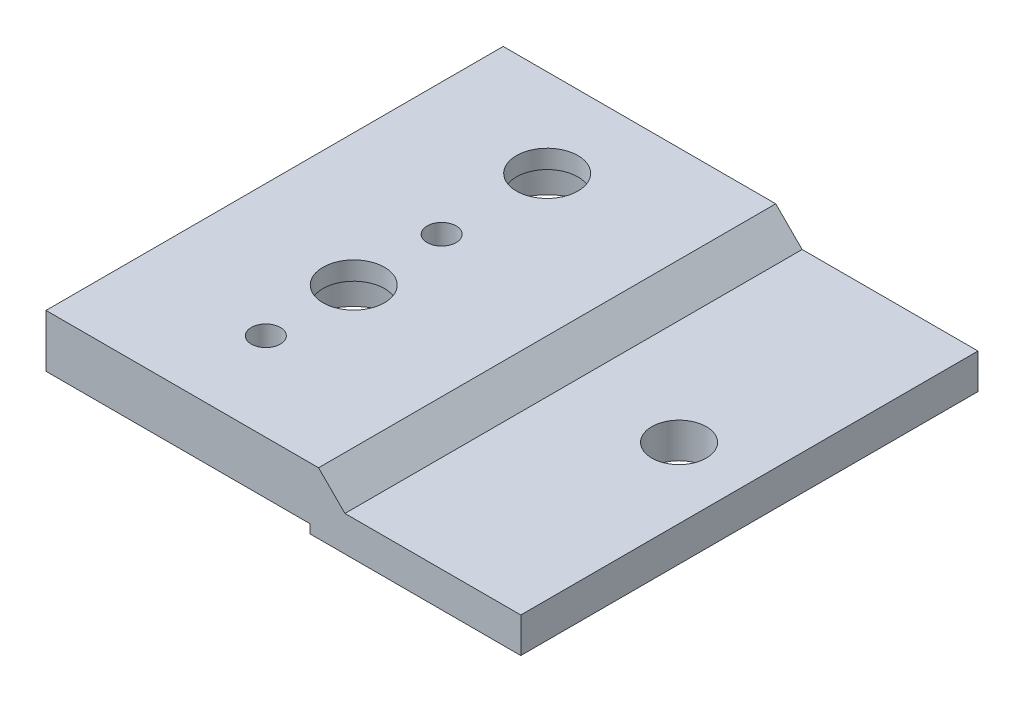
ISO-10303-21;
HEADER;
FILE_DESCRIPTION(('STEP AP214'),'2;1');
FILE_NAME('part.step','',(''),(''),'','','');
FILE_SCHEMA(('AUTOMOTIVE_DESIGN { 1 0 10303 214 1 1 1 1 }'));
ENDSEC;
DATA;
#1=APPLICATION_CONTEXT('core data for automotive mechanical design processes');
#2=APPLICATION_PROTOCOL_DEFINITION('international standard','automotive_design',2000,#1);
#3=PRODUCT_CONTEXT('',#1,'mechanical');
#4=PRODUCT('Part','Part','',(#3));
#5=PRODUCT_RELATED_PRODUCT_CATEGORY('part','',(#4));
#6=PRODUCT_DEFINITION_FORMATION('','',#4);
#7=PRODUCT_DEFINITION_CONTEXT('part definition',#1,'design');
#8=PRODUCT_DEFINITION('design','',#6,#7);
#9=PRODUCT_DEFINITION_SHAPE('','',#8);
#10=(LENGTH_UNIT() NAMED_UNIT(*) SI_UNIT(.MILLI.,.METRE.));
#11=(NAMED_UNIT(*) PLANE_ANGLE_UNIT() SI_UNIT($,.RADIAN.));
#12=(NAMED_UNIT(*) SI_UNIT($,.STERADIAN.) SOLID_ANGLE_UNIT());
#13=UNCERTAINTY_MEASURE_WITH_UNIT(LENGTH_MEASURE(1.E-05),#10,'distance_accuracy_value','');
#14=(GEOMETRIC_REPRESENTATION_CONTEXT(3) GLOBAL_UNCERTAINTY_ASSIGNED_CONTEXT((#13)) GLOBAL_UNIT_ASSIGNED_CONTEXT((#10,
#11,#12)) REPRESENTATION_CONTEXT('',''));
#15=CARTESIAN_POINT('',(0.,0.,0.));
#16=DIRECTION('',(0.,0.,1.));
#17=DIRECTION('',(1.,0.,0.));
#18=AXIS2_PLACEMENT_3D('',#15,#16,#17);
#19=CARTESIAN_POINT('',(19.,7.,-40.));
#20=DIRECTION('',(0.,1.,0.));
#21=DIRECTION('',(-1.,0.,0.));
#22=AXIS2_PLACEMENT_3D('',#19,#20,#21);
#23=PLANE('',#22);
#24=CARTESIAN_POINT('',(0.,7.,-42.));
#25=DIRECTION('',(0.,-1.,0.));
#26=DIRECTION('',(0.,0.,-1.));
#27=AXIS2_PLACEMENT_3D('',#24,#25,#26);
#28=CIRCLE('',#27,3.5);
#29=CARTESIAN_POINT('',(0.,7.,-45.5));
#30=VERTEX_POINT('',#29);
#31=EDGE_CURVE('E426',#30,#30,#28,.T.);
#32=ORIENTED_EDGE('',*,*,#31,.T.);
#33=EDGE_LOOP('',(#32));
#34=FACE_BOUND('',#33,.T.);
#35=CARTESIAN_POINT('',(0.,7.,-20.));
#36=DIRECTION('',(0.,-1.,0.));
#37=DIRECTION('',(0.,0.,-1.));
#38=AXIS2_PLACEMENT_3D('',#35,#36,#37);
#39=CIRCLE('',#38,3.5);
#40=CARTESIAN_POINT('',(0.,7.,-23.5));
#41=VERTEX_POINT('',#40);
#42=EDGE_CURVE('E146',#41,#41,#39,.T.);
#43=ORIENTED_EDGE('',*,*,#42,.T.);
#44=EDGE_LOOP('',(#43));
#45=FACE_BOUND('',#44,.T.);
#46=CARTESIAN_POINT('',(0.,7.,-10.));
#47=DIRECTION('',(0.,1.,0.));
#48=DIRECTION('',(-1.,0.,0.));
#49=AXIS2_PLACEMENT_3D('',#46,#47,#48);
#50=CIRCLE('',#49,1.64999999999999);
#51=CARTESIAN_POINT('',(-1.64999999999999,7.,-10.));
#52=VERTEX_POINT('',#51);
#53=EDGE_CURVE('E152',#52,#52,#50,.T.);
#54=ORIENTED_EDGE('',*,*,#53,.F.);
#55=EDGE_LOOP('',(#54));
#56=FACE_BOUND('',#55,.T.);
#57=CARTESIAN_POINT('',(0.,7.,-30.));
#58=DIRECTION('',(0.,1.,0.));
#59=DIRECTION('',(-1.,0.,0.));
#60=AXIS2_PLACEMENT_3D('',#57,#58,#59);
#61=CIRCLE('',#60,1.64999999999999);
#62=CARTESIAN_POINT('',(-1.64999999999999,7.,-30.));
#63=VERTEX_POINT('',#62);
#64=EDGE_CURVE('E158',#63,#63,#61,.T.);
#65=ORIENTED_EDGE('',*,*,#64,.F.);
#66=EDGE_LOOP('',(#65));
#67=FACE_BOUND('',#66,.T.);
#68=DIRECTION('',(-1.,0.,0.));
#69=VECTOR('',#68,1.);
#70=CARTESIAN_POINT('',(19.,7.,0.));
#71=LINE('',#70,#69);
#72=CARTESIAN_POINT('',(16.,7.,0.));
#73=VERTEX_POINT('',#72);
#74=CARTESIAN_POINT('',(-15.,7.,0.));
#75=VERTEX_POINT('',#74);
#76=EDGE_CURVE('E161',#73,#75,#71,.T.);
#77=ORIENTED_EDGE('',*,*,#76,.F.);
#78=DIRECTION('',(0.,0.,-1.));
#79=VECTOR('',#78,1.);
#80=CARTESIAN_POINT('',(16.,7.,-40.));
#81=LINE('',#80,#79);
#82=CARTESIAN_POINT('',(16.,7.,-52.));
#83=VERTEX_POINT('',#82);
#84=EDGE_CURVE('E43',#73,#83,#81,.T.);
#85=ORIENTED_EDGE('',*,*,#84,.T.);
#86=DIRECTION('',(1.,0.,0.));
#87=VECTOR('',#86,1.);
#88=CARTESIAN_POINT('',(-15.,7.,-52.));
#89=LINE('',#88,#87);
#90=CARTESIAN_POINT('',(-15.,7.,-52.));
#91=VERTEX_POINT('',#90);
#92=EDGE_CURVE('E109',#91,#83,#89,.T.);
#93=ORIENTED_EDGE('',*,*,#92,.F.);
#94=DIRECTION('',(0.,0.,1.));
#95=VECTOR('',#94,1.);
#96=CARTESIAN_POINT('',(-15.,7.,-40.));
#97=LINE('',#96,#95);
#98=EDGE_CURVE('E100',#91,#75,#97,.T.);
#99=ORIENTED_EDGE('',*,*,#98,.T.);
#100=EDGE_LOOP('',(#77,#85,#93,#99));
#101=FACE_BOUND('',#100,.T.);
#102=ADVANCED_FACE('F35',(#34,#45,#56,#67,#101),#23,.T.);
#103=CARTESIAN_POINT('',(39.,4.,-40.));
#104=DIRECTION('',(0.,1.,0.));
#105=DIRECTION('',(-1.,0.,0.));
#106=AXIS2_PLACEMENT_3D('',#103,#104,#105);
#107=PLANE('',#106);
#108=CARTESIAN_POINT('',(31.,4.,-26.));
#109=DIRECTION('',(0.,1.,0.));
#110=DIRECTION('',(0.,0.,1.));
#111=AXIS2_PLACEMENT_3D('',#108,#109,#110);
#112=CIRCLE('',#111,3.09999999999998);
#113=CARTESIAN_POINT('',(31.,4.,-22.9));
#114=VERTEX_POINT('',#113);
#115=EDGE_CURVE('E439',#114,#114,#112,.T.);
#116=ORIENTED_EDGE('',*,*,#115,.F.);
#117=EDGE_LOOP('',(#116));
#118=FACE_BOUND('',#117,.T.);
#119=DIRECTION('',(-1.,0.,0.));
#120=VECTOR('',#119,1.);
#121=CARTESIAN_POINT('',(39.,4.,0.));
#122=LINE('',#121,#120);
#123=CARTESIAN_POINT('',(39.,4.,0.));
#124=VERTEX_POINT('',#123);
#125=CARTESIAN_POINT('',(19.,4.,0.));
#126=VERTEX_POINT('',#125);
#127=EDGE_CURVE('E107',#124,#126,#122,.T.);
#128=ORIENTED_EDGE('',*,*,#127,.F.);
#129=DIRECTION('',(0.,0.,1.));
#130=VECTOR('',#129,1.);
#131=CARTESIAN_POINT('',(39.,4.,-40.));
#132=LINE('',#131,#130);
#133=CARTESIAN_POINT('',(39.,4.,-52.));
#134=VERTEX_POINT('',#133);
#135=EDGE_CURVE('E180',#134,#124,#132,.T.);
#136=ORIENTED_EDGE('',*,*,#135,.F.);
#137=DIRECTION('',(1.,0.,0.));
#138=VECTOR('',#137,1.);
#139=CARTESIAN_POINT('',(19.,4.,-52.));
#140=LINE('',#139,#138);
#141=CARTESIAN_POINT('',(19.,4.,-52.));
#142=VERTEX_POINT('',#141);
#143=EDGE_CURVE('E112',#142,#134,#140,.T.);
#144=ORIENTED_EDGE('',*,*,#143,.F.);
#145=DIRECTION('',(0.,0.,1.));
#146=VECTOR('',#145,1.);
#147=CARTESIAN_POINT('',(19.,4.,-40.));
#148=LINE('',#147,#146);
#149=EDGE_CURVE('E177',#142,#126,#148,.T.);
#150=ORIENTED_EDGE('',*,*,#149,.T.);
#151=EDGE_LOOP('',(#128,#136,#144,#150));
#152=FACE_BOUND('',#151,.T.);
#153=ADVANCED_FACE('F200',(#118,#152),#107,.T.);
#154=CARTESIAN_POINT('',(39.,0.,-40.));
#155=DIRECTION('',(1.,0.,0.));
#156=DIRECTION('',(0.,1.,0.));
#157=AXIS2_PLACEMENT_3D('',#154,#155,#156);
#158=PLANE('',#157);
#159=DIRECTION('',(0.,1.,0.));
#160=VECTOR('',#159,1.);
#161=CARTESIAN_POINT('',(39.,0.,0.));
#162=LINE('',#161,#160);
#163=CARTESIAN_POINT('',(39.,0.,0.));
#164=VERTEX_POINT('',#163);
#165=EDGE_CURVE('E173',#164,#124,#162,.T.);
#166=ORIENTED_EDGE('',*,*,#165,.F.);
#167=DIRECTION('',(0.,0.,1.));
#168=VECTOR('',#167,1.);
#169=CARTESIAN_POINT('',(39.,0.,-40.));
#170=LINE('',#169,#168);
#171=CARTESIAN_POINT('',(39.,0.,-52.));
#172=VERTEX_POINT('',#171);
#173=EDGE_CURVE('E182',#172,#164,#170,.T.);
#174=ORIENTED_EDGE('',*,*,#173,.F.);
#175=DIRECTION('',(0.,-1.,0.));
#176=VECTOR('',#175,1.);
#177=CARTESIAN_POINT('',(39.,4.,-52.));
#178=LINE('',#177,#176);
#179=EDGE_CURVE('E128',#134,#172,#178,.T.);
#180=ORIENTED_EDGE('',*,*,#179,.F.);
#181=ORIENTED_EDGE('',*,*,#135,.T.);
#182=EDGE_LOOP('',(#166,#174,#180,#181));
#183=FACE_BOUND('',#182,.T.);
#184=ADVANCED_FACE('F203',(#183),#158,.T.);
#185=CARTESIAN_POINT('',(15.,0.,-40.));
#186=DIRECTION('',(0.,-1.,0.));
#187=DIRECTION('',(1.,0.,0.));
#188=AXIS2_PLACEMENT_3D('',#185,#186,#187);
#189=PLANE('',#188);
#190=CARTESIAN_POINT('',(31.,0.,-26.));
#191=DIRECTION('',(0.,-1.,0.));
#192=DIRECTION('',(1.,0.,0.));
#193=AXIS2_PLACEMENT_3D('',#190,#191,#192);
#194=CIRCLE('',#193,3.09999999999999);
#195=CARTESIAN_POINT('',(34.1,0.,-26.));
#196=VERTEX_POINT('',#195);
#197=EDGE_CURVE('E436',#196,#196,#194,.T.);
#198=ORIENTED_EDGE('',*,*,#197,.F.);
#199=EDGE_LOOP('',(#198));
#200=FACE_BOUND('',#199,.T.);
#201=DIRECTION('',(1.,0.,0.));
#202=VECTOR('',#201,1.);
#203=CARTESIAN_POINT('',(15.,0.,0.));
#204=LINE('',#203,#202);
#205=CARTESIAN_POINT('',(15.,0.,0.));
#206=VERTEX_POINT('',#205);
#207=EDGE_CURVE('E170',#206,#164,#204,.T.);
#208=ORIENTED_EDGE('',*,*,#207,.F.);
#209=DIRECTION('',(0.,0.,1.));
#210=VECTOR('',#209,1.);
#211=CARTESIAN_POINT('',(15.,0.,-40.));
#212=LINE('',#211,#210);
#213=CARTESIAN_POINT('',(15.,0.,-52.));
#214=VERTEX_POINT('',#213);
#215=EDGE_CURVE('E184',#214,#206,#212,.T.);
#216=ORIENTED_EDGE('',*,*,#215,.F.);
#217=DIRECTION('',(-1.,0.,0.));
#218=VECTOR('',#217,1.);
#219=CARTESIAN_POINT('',(39.,0.,-52.));
#220=LINE('',#219,#218);
#221=EDGE_CURVE('E131',#172,#214,#220,.T.);
#222=ORIENTED_EDGE('',*,*,#221,.F.);
#223=ORIENTED_EDGE('',*,*,#173,.T.);
#224=EDGE_LOOP('',(#208,#216,#222,#223));
#225=FACE_BOUND('',#224,.T.);
#226=ADVANCED_FACE('F208',(#200,#225),#189,.T.);
#227=CARTESIAN_POINT('',(15.,1.,-40.));
#228=DIRECTION('',(-1.,0.,0.));
#229=DIRECTION('',(0.,-1.,0.));
#230=AXIS2_PLACEMENT_3D('',#227,#228,#229);
#231=PLANE('',#230);
#232=DIRECTION('',(0.,-1.,0.));
#233=VECTOR('',#232,1.);
#234=CARTESIAN_POINT('',(15.,1.,0.));
#235=LINE('',#234,#233);
#236=CARTESIAN_POINT('',(15.,1.,0.));
#237=VERTEX_POINT('',#236);
#238=EDGE_CURVE('E167',#237,#206,#235,.T.);
#239=ORIENTED_EDGE('',*,*,#238,.F.);
#240=DIRECTION('',(0.,0.,1.));
#241=VECTOR('',#240,1.);
#242=CARTESIAN_POINT('',(15.,1.,-40.));
#243=LINE('',#242,#241);
#244=CARTESIAN_POINT('',(15.,1.,-52.));
#245=VERTEX_POINT('',#244);
#246=EDGE_CURVE('E186',#245,#237,#243,.T.);
#247=ORIENTED_EDGE('',*,*,#246,.F.);
#248=DIRECTION('',(0.,1.,0.));
#249=VECTOR('',#248,1.);
#250=CARTESIAN_POINT('',(15.,0.,-52.));
#251=LINE('',#250,#249);
#252=EDGE_CURVE('E134',#214,#245,#251,.T.);
#253=ORIENTED_EDGE('',*,*,#252,.F.);
#254=ORIENTED_EDGE('',*,*,#215,.T.);
#255=EDGE_LOOP('',(#239,#247,#253,#254));
#256=FACE_BOUND('',#255,.T.);
#257=ADVANCED_FACE('F210',(#256),#231,.T.);
#258=CARTESIAN_POINT('',(-15.,0.999999999999996,-40.));
#259=DIRECTION('',(0.,-1.,0.));
#260=DIRECTION('',(1.,0.,0.));
#261=AXIS2_PLACEMENT_3D('',#258,#259,#260);
#262=PLANE('',#261);
#263=CARTESIAN_POINT('',(0.,0.999999999999998,-42.));
#264=DIRECTION('',(0.,-1.,0.));
#265=DIRECTION('',(0.,0.,-1.));
#266=AXIS2_PLACEMENT_3D('',#263,#264,#265);
#267=CIRCLE('',#266,5.5);
#268=CARTESIAN_POINT('',(0.,0.999999999999998,-47.5));
#269=VERTEX_POINT('',#268);
#270=EDGE_CURVE('E431',#269,#269,#267,.T.);
#271=ORIENTED_EDGE('',*,*,#270,.F.);
#272=EDGE_LOOP('',(#271));
#273=FACE_BOUND('',#272,.T.);
#274=CARTESIAN_POINT('',(0.,0.999999999999998,-20.));
#275=DIRECTION('',(0.,-1.,0.));
#276=DIRECTION('',(0.,0.,-1.));
#277=AXIS2_PLACEMENT_3D('',#274,#275,#276);
#278=CIRCLE('',#277,5.5);
#279=CARTESIAN_POINT('',(0.,0.999999999999998,-25.5));
#280=VERTEX_POINT('',#279);
#281=EDGE_CURVE('E137',#280,#280,#278,.T.);
#282=ORIENTED_EDGE('',*,*,#281,.F.);
#283=EDGE_LOOP('',(#282));
#284=FACE_BOUND('',#283,.T.);
#285=CARTESIAN_POINT('',(0.,0.999999999999997,-10.));
#286=DIRECTION('',(0.,-1.,0.));
#287=DIRECTION('',(0.,0.,-1.));
#288=AXIS2_PLACEMENT_3D('',#285,#286,#287);
#289=CIRCLE('',#288,1.64999999999999);
#290=CARTESIAN_POINT('',(0.,0.999999999999997,-11.65));
#291=VERTEX_POINT('',#290);
#292=EDGE_CURVE('E149',#291,#291,#289,.T.);
#293=ORIENTED_EDGE('',*,*,#292,.F.);
#294=EDGE_LOOP('',(#293));
#295=FACE_BOUND('',#294,.T.);
#296=CARTESIAN_POINT('',(0.,0.999999999999997,-30.));
#297=DIRECTION('',(0.,-1.,0.));
#298=DIRECTION('',(0.,0.,-1.));
#299=AXIS2_PLACEMENT_3D('',#296,#297,#298);
#300=CIRCLE('',#299,1.64999999999999);
#301=CARTESIAN_POINT('',(0.,0.999999999999997,-31.65));
#302=VERTEX_POINT('',#301);
#303=EDGE_CURVE('E155',#302,#302,#300,.T.);
#304=ORIENTED_EDGE('',*,*,#303,.F.);
#305=EDGE_LOOP('',(#304));
#306=FACE_BOUND('',#305,.T.);
#307=DIRECTION('',(1.,0.,0.));
#308=VECTOR('',#307,1.);
#309=CARTESIAN_POINT('',(-15.,0.999999999999996,0.));
#310=LINE('',#309,#308);
#311=CARTESIAN_POINT('',(-15.,0.999999999999996,0.));
#312=VERTEX_POINT('',#311);
#313=EDGE_CURVE('E164',#312,#237,#310,.T.);
#314=ORIENTED_EDGE('',*,*,#313,.F.);
#315=DIRECTION('',(0.,0.,1.));
#316=VECTOR('',#315,1.);
#317=CARTESIAN_POINT('',(-15.,0.999999999999996,-40.));
#318=LINE('',#317,#316);
#319=CARTESIAN_POINT('',(-15.,0.999999999999996,-52.));
#320=VERTEX_POINT('',#319);
#321=EDGE_CURVE('E106',#320,#312,#318,.T.);
#322=ORIENTED_EDGE('',*,*,#321,.F.);
#323=DIRECTION('',(-1.,0.,0.));
#324=VECTOR('',#323,1.);
#325=CARTESIAN_POINT('',(15.,1.,-52.));
#326=LINE('',#325,#324);
#327=EDGE_CURVE('E118',#245,#320,#326,.T.);
#328=ORIENTED_EDGE('',*,*,#327,.F.);
#329=ORIENTED_EDGE('',*,*,#246,.T.);
#330=EDGE_LOOP('',(#314,#322,#328,#329));
#331=FACE_BOUND('',#330,.T.);
#332=ADVANCED_FACE('F191',(#273,#284,#295,#306,#331),#262,.T.);
#333=CARTESIAN_POINT('',(-15.,7.,-40.));
#334=DIRECTION('',(-1.,0.,0.));
#335=DIRECTION('',(0.,0.,1.));
#336=AXIS2_PLACEMENT_3D('',#333,#334,#335);
#337=PLANE('',#336);
#338=DIRECTION('',(0.,-1.,0.));
#339=VECTOR('',#338,1.);
#340=CARTESIAN_POINT('',(-15.,7.,0.));
#341=LINE('',#340,#339);
#342=EDGE_CURVE('E105',#75,#312,#341,.T.);
#343=ORIENTED_EDGE('',*,*,#342,.F.);
#344=ORIENTED_EDGE('',*,*,#98,.F.);
#345=DIRECTION('',(0.,1.,0.));
#346=VECTOR('',#345,1.);
#347=CARTESIAN_POINT('',(-15.,0.999999999999996,-52.));
#348=LINE('',#347,#346);
#349=EDGE_CURVE('E103',#320,#91,#348,.T.);
#350=ORIENTED_EDGE('',*,*,#349,.F.);
#351=ORIENTED_EDGE('',*,*,#321,.T.);
#352=EDGE_LOOP('',(#343,#344,#350,#351));
#353=FACE_BOUND('',#352,.T.);
#354=ADVANCED_FACE('F101',(#353),#337,.T.);
#355=CARTESIAN_POINT('',(-15.,7.,0.));
#356=DIRECTION('',(0.,0.,1.));
#357=DIRECTION('',(1.,0.,0.));
#358=AXIS2_PLACEMENT_3D('',#355,#356,#357);
#359=PLANE('',#358);
#360=ORIENTED_EDGE('',*,*,#127,.T.);
#361=DIRECTION('',(0.707106781186549,-0.707106781186546,0.));
#362=VECTOR('',#361,1.);
#363=CARTESIAN_POINT('',(0.499999999999928,22.5,0.));
#364=LINE('',#363,#362);
#365=EDGE_CURVE('E57',#126,#73,#364,.F.);
#366=ORIENTED_EDGE('',*,*,#365,.T.);
#367=ORIENTED_EDGE('',*,*,#76,.T.);
#368=ORIENTED_EDGE('',*,*,#342,.T.);
#369=ORIENTED_EDGE('',*,*,#313,.T.);
#370=ORIENTED_EDGE('',*,*,#238,.T.);
#371=ORIENTED_EDGE('',*,*,#207,.T.);
#372=ORIENTED_EDGE('',*,*,#165,.T.);
#373=EDGE_LOOP('',(#360,#366,#367,#368,#369,#370,#371,#372));
#374=FACE_BOUND('',#373,.T.);
#375=ADVANCED_FACE('F193',(#374),#359,.T.);
#376=CARTESIAN_POINT('',(0.,0.999999999999998,-30.));
#377=DIRECTION('',(0.,-1.,0.));
#378=DIRECTION('',(0.,0.,-1.));
#379=AXIS2_PLACEMENT_3D('',#376,#377,#378);
#380=CYLINDRICAL_SURFACE('',#379,1.64999999999999);
#381=ORIENTED_EDGE('',*,*,#303,.T.);
#382=EDGE_LOOP('',(#381));
#383=FACE_BOUND('',#382,.T.);
#384=ORIENTED_EDGE('',*,*,#64,.T.);
#385=EDGE_LOOP('',(#384));
#386=FACE_BOUND('',#385,.T.);
#387=ADVANCED_FACE('F235',(#383,#386),#380,.F.);
#388=CARTESIAN_POINT('',(0.,0.999999999999998,-10.));
#389=DIRECTION('',(0.,-1.,0.));
#390=DIRECTION('',(0.,0.,-1.));
#391=AXIS2_PLACEMENT_3D('',#388,#389,#390);
#392=CYLINDRICAL_SURFACE('',#391,1.64999999999999);
#393=ORIENTED_EDGE('',*,*,#292,.T.);
#394=EDGE_LOOP('',(#393));
#395=FACE_BOUND('',#394,.T.);
#396=ORIENTED_EDGE('',*,*,#53,.T.);
#397=EDGE_LOOP('',(#396));
#398=FACE_BOUND('',#397,.T.);
#399=ADVANCED_FACE('F240',(#395,#398),#392,.F.);
#400=CARTESIAN_POINT('',(0.,0.999999999999998,-20.));
#401=DIRECTION('',(0.,-1.,0.));
#402=DIRECTION('',(0.,0.,-1.));
#403=AXIS2_PLACEMENT_3D('',#400,#401,#402);
#404=CYLINDRICAL_SURFACE('',#403,3.5);
#405=ORIENTED_EDGE('',*,*,#42,.F.);
#406=EDGE_LOOP('',(#405));
#407=FACE_BOUND('',#406,.T.);
#408=CARTESIAN_POINT('',(0.,4.9,-20.));
#409=DIRECTION('',(0.,-1.,0.));
#410=DIRECTION('',(0.,0.,-1.));
#411=AXIS2_PLACEMENT_3D('',#408,#409,#410);
#412=CIRCLE('',#411,3.5);
#413=CARTESIAN_POINT('',(0.,4.9,-23.5));
#414=VERTEX_POINT('',#413);
#415=EDGE_CURVE('E143',#414,#414,#412,.T.);
#416=ORIENTED_EDGE('',*,*,#415,.T.);
#417=EDGE_LOOP('',(#416));
#418=FACE_BOUND('',#417,.T.);
#419=ADVANCED_FACE('F321',(#407,#418),#404,.F.);
#420=CARTESIAN_POINT('',(3.5,4.9,-20.));
#421=DIRECTION('',(0.,1.,0.));
#422=DIRECTION('',(0.,0.,1.));
#423=AXIS2_PLACEMENT_3D('',#420,#421,#422);
#424=PLANE('',#423);
#425=ORIENTED_EDGE('',*,*,#415,.F.);
#426=EDGE_LOOP('',(#425));
#427=FACE_BOUND('',#426,.T.);
#428=CARTESIAN_POINT('',(0.,4.9,-20.));
#429=DIRECTION('',(0.,-1.,0.));
#430=DIRECTION('',(0.,0.,-1.));
#431=AXIS2_PLACEMENT_3D('',#428,#429,#430);
#432=CIRCLE('',#431,5.5);
#433=CARTESIAN_POINT('',(0.,4.9,-25.5));
#434=VERTEX_POINT('',#433);
#435=EDGE_CURVE('E140',#434,#434,#432,.T.);
#436=ORIENTED_EDGE('',*,*,#435,.T.);
#437=EDGE_LOOP('',(#436));
#438=FACE_BOUND('',#437,.T.);
#439=ADVANCED_FACE('F313',(#427,#438),#424,.F.);
#440=CARTESIAN_POINT('',(0.,0.999999999999998,-20.));
#441=DIRECTION('',(0.,-1.,0.));
#442=DIRECTION('',(0.,0.,-1.));
#443=AXIS2_PLACEMENT_3D('',#440,#441,#442);
#444=CYLINDRICAL_SURFACE('',#443,5.5);
#445=ORIENTED_EDGE('',*,*,#435,.F.);
#446=EDGE_LOOP('',(#445));
#447=FACE_BOUND('',#446,.T.);
#448=ORIENTED_EDGE('',*,*,#281,.T.);
#449=EDGE_LOOP('',(#448));
#450=FACE_BOUND('',#449,.T.);
#451=ADVANCED_FACE('F307',(#447,#450),#444,.F.);
#452=CARTESIAN_POINT('',(-15.,7.,-52.));
#453=DIRECTION('',(0.,0.,-1.));
#454=DIRECTION('',(-1.,0.,0.));
#455=AXIS2_PLACEMENT_3D('',#452,#453,#454);
#456=PLANE('',#455);
#457=ORIENTED_EDGE('',*,*,#92,.T.);
#458=DIRECTION('',(-0.707106781186549,0.707106781186546,0.));
#459=VECTOR('',#458,1.);
#460=CARTESIAN_POINT('',(0.499999999999928,22.5,-52.));
#461=LINE('',#460,#459);
#462=EDGE_CURVE('E11',#83,#142,#461,.F.);
#463=ORIENTED_EDGE('',*,*,#462,.T.);
#464=ORIENTED_EDGE('',*,*,#143,.T.);
#465=ORIENTED_EDGE('',*,*,#179,.T.);
#466=ORIENTED_EDGE('',*,*,#221,.T.);
#467=ORIENTED_EDGE('',*,*,#252,.T.);
#468=ORIENTED_EDGE('',*,*,#327,.T.);
#469=ORIENTED_EDGE('',*,*,#349,.T.);
#470=EDGE_LOOP('',(#457,#463,#464,#465,#466,#467,#468,#469));
#471=FACE_BOUND('',#470,.T.);
#472=ADVANCED_FACE('F115',(#471),#456,.T.);
#473=CARTESIAN_POINT('',(0.,0.999999999999998,-42.));
#474=DIRECTION('',(0.,-1.,0.));
#475=DIRECTION('',(0.,0.,-1.));
#476=AXIS2_PLACEMENT_3D('',#473,#474,#475);
#477=CYLINDRICAL_SURFACE('',#476,3.5);
#478=ORIENTED_EDGE('',*,*,#31,.F.);
#479=EDGE_LOOP('',(#478));
#480=FACE_BOUND('',#479,.T.);
#481=CARTESIAN_POINT('',(0.,4.9,-42.));
#482=DIRECTION('',(0.,-1.,0.));
#483=DIRECTION('',(0.,0.,-1.));
#484=AXIS2_PLACEMENT_3D('',#481,#482,#483);
#485=CIRCLE('',#484,3.5);
#486=CARTESIAN_POINT('',(0.,4.9,-45.5));
#487=VERTEX_POINT('',#486);
#488=EDGE_CURVE('E119',#487,#487,#485,.T.);
#489=ORIENTED_EDGE('',*,*,#488,.T.);
#490=EDGE_LOOP('',(#489));
#491=FACE_BOUND('',#490,.T.);
#492=ADVANCED_FACE('F279',(#480,#491),#477,.F.);
#493=CARTESIAN_POINT('',(3.5,4.9,-42.));
#494=DIRECTION('',(0.,1.,0.));
#495=DIRECTION('',(0.,0.,1.));
#496=AXIS2_PLACEMENT_3D('',#493,#494,#495);
#497=PLANE('',#496);
#498=ORIENTED_EDGE('',*,*,#488,.F.);
#499=EDGE_LOOP('',(#498));
#500=FACE_BOUND('',#499,.T.);
#501=CARTESIAN_POINT('',(0.,4.9,-42.));
#502=DIRECTION('',(0.,-1.,0.));
#503=DIRECTION('',(0.,0.,-1.));
#504=AXIS2_PLACEMENT_3D('',#501,#502,#503);
#505=CIRCLE('',#504,5.5);
#506=CARTESIAN_POINT('',(0.,4.9,-47.5));
#507=VERTEX_POINT('',#506);
#508=EDGE_CURVE('E122',#507,#507,#505,.T.);
#509=ORIENTED_EDGE('',*,*,#508,.T.);
#510=EDGE_LOOP('',(#509));
#511=FACE_BOUND('',#510,.T.);
#512=ADVANCED_FACE('F285',(#500,#511),#497,.F.);
#513=CARTESIAN_POINT('',(0.,0.999999999999998,-42.));
#514=DIRECTION('',(0.,-1.,0.));
#515=DIRECTION('',(0.,0.,-1.));
#516=AXIS2_PLACEMENT_3D('',#513,#514,#515);
#517=CYLINDRICAL_SURFACE('',#516,5.5);
#518=ORIENTED_EDGE('',*,*,#508,.F.);
#519=EDGE_LOOP('',(#518));
#520=FACE_BOUND('',#519,.T.);
#521=ORIENTED_EDGE('',*,*,#270,.T.);
#522=EDGE_LOOP('',(#521));
#523=FACE_BOUND('',#522,.T.);
#524=ADVANCED_FACE('F278',(#520,#523),#517,.F.);
#525=CARTESIAN_POINT('',(19.,4.00000000000001,-40.));
#526=DIRECTION('',(-0.707106781186546,-0.707106781186549,0.));
#527=DIRECTION('',(0.707106781186549,-0.707106781186546,0.));
#528=AXIS2_PLACEMENT_3D('',#525,#526,#527);
#529=PLANE('',#528);
#530=ORIENTED_EDGE('',*,*,#462,.F.);
#531=ORIENTED_EDGE('',*,*,#84,.F.);
#532=ORIENTED_EDGE('',*,*,#365,.F.);
#533=ORIENTED_EDGE('',*,*,#149,.F.);
#534=EDGE_LOOP('',(#530,#531,#532,#533));
#535=FACE_BOUND('',#534,.T.);
#536=ADVANCED_FACE('F37',(#535),#529,.F.);
#537=CARTESIAN_POINT('',(31.,4.,-26.));
#538=DIRECTION('',(0.,1.,0.));
#539=DIRECTION('',(0.,0.,1.));
#540=AXIS2_PLACEMENT_3D('',#537,#538,#539);
#541=CYLINDRICAL_SURFACE('',#540,3.09999999999999);
#542=ORIENTED_EDGE('',*,*,#115,.T.);
#543=EDGE_LOOP('',(#542));
#544=FACE_BOUND('',#543,.T.);
#545=ORIENTED_EDGE('',*,*,#197,.T.);
#546=EDGE_LOOP('',(#545));
#547=FACE_BOUND('',#546,.T.);
#548=ADVANCED_FACE('F265',(#544,#547),#541,.F.);
#549=CLOSED_SHELL('',(#102,#153,#184,#226,#257,#332,#354,#375,#387,#399,#419,#439,#451,#472,
#492,#512,#524,#536,#548));
#550=MANIFOLD_SOLID_BREP('B2',#549);
#551=ADVANCED_BREP_SHAPE_REPRESENTATION('',(#18,#550),#14);
#552=SHAPE_DEFINITION_REPRESENTATION(#9,#551);
ENDSEC;
END-ISO-10303-21;
